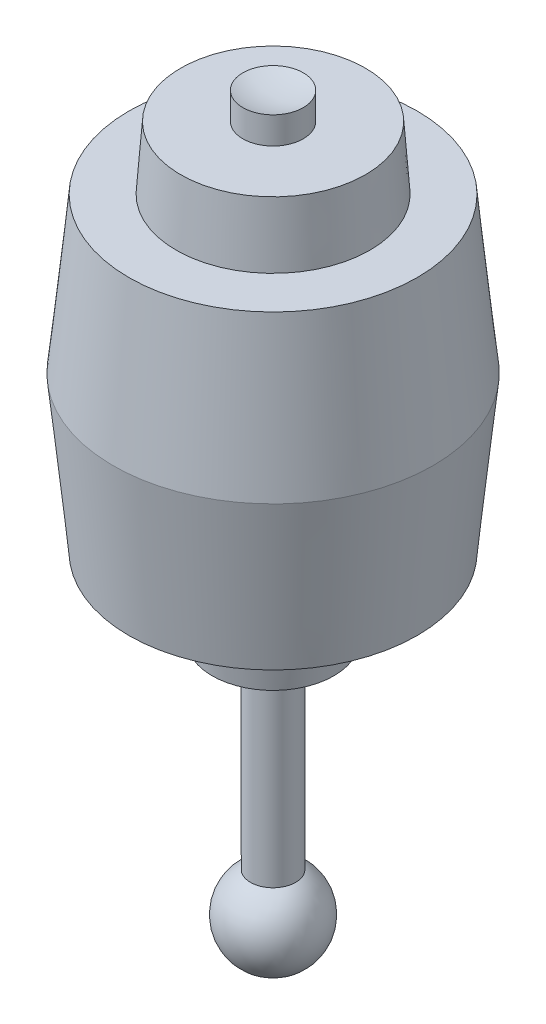
ISO-10303-21;
HEADER;
FILE_DESCRIPTION(('STEP AP214'),'2;1');
FILE_NAME('part.step','',(''),(''),'','','');
FILE_SCHEMA(('AUTOMOTIVE_DESIGN { 1 0 10303 214 1 1 1 1 }'));
ENDSEC;
DATA;
#1=APPLICATION_CONTEXT('core data for automotive mechanical design processes');
#2=APPLICATION_PROTOCOL_DEFINITION('international standard','automotive_design',2000,#1);
#3=PRODUCT_CONTEXT('',#1,'mechanical');
#4=PRODUCT('Part','Part','',(#3));
#5=PRODUCT_RELATED_PRODUCT_CATEGORY('part','',(#4));
#6=PRODUCT_DEFINITION_FORMATION('','',#4);
#7=PRODUCT_DEFINITION_CONTEXT('part definition',#1,'design');
#8=PRODUCT_DEFINITION('design','',#6,#7);
#9=PRODUCT_DEFINITION_SHAPE('','',#8);
#10=(LENGTH_UNIT() NAMED_UNIT(*) SI_UNIT(.MILLI.,.METRE.));
#11=(NAMED_UNIT(*) PLANE_ANGLE_UNIT() SI_UNIT($,.RADIAN.));
#12=(NAMED_UNIT(*) SI_UNIT($,.STERADIAN.) SOLID_ANGLE_UNIT());
#13=UNCERTAINTY_MEASURE_WITH_UNIT(LENGTH_MEASURE(1.E-05),#10,'distance_accuracy_value','');
#14=(GEOMETRIC_REPRESENTATION_CONTEXT(3) GLOBAL_UNCERTAINTY_ASSIGNED_CONTEXT((#13)) GLOBAL_UNIT_ASSIGNED_CONTEXT((#10,
#11,#12)) REPRESENTATION_CONTEXT('',''));
#15=CARTESIAN_POINT('',(0.,0.,0.));
#16=DIRECTION('',(0.,0.,1.));
#17=DIRECTION('',(1.,0.,0.));
#18=AXIS2_PLACEMENT_3D('',#15,#16,#17);
#19=CARTESIAN_POINT('',(0.,-52.,0.));
#20=DIRECTION('',(0.,-1.,0.));
#21=DIRECTION('',(-1.,0.,0.));
#22=AXIS2_PLACEMENT_3D('',#19,#20,#21);
#23=SPHERICAL_SURFACE('',#22,5.);
#24=CARTESIAN_POINT('',(0.,-47.6698729810778,0.));
#25=DIRECTION('',(0.,-1.,0.));
#26=DIRECTION('',(1.,0.,0.));
#27=AXIS2_PLACEMENT_3D('',#24,#25,#26);
#28=CIRCLE('',#27,2.5);
#29=CARTESIAN_POINT('',(2.50000000000001,-47.6698729810778,0.));
#30=VERTEX_POINT('',#29);
#31=EDGE_CURVE('E67',#30,#30,#28,.T.);
#32=ORIENTED_EDGE('',*,*,#31,.T.);
#33=EDGE_LOOP('',(#32));
#34=FACE_BOUND('',#33,.T.);
#35=ADVANCED_FACE('F30',(#34),#23,.T.);
#36=CARTESIAN_POINT('',(0.,36.6221812761165,0.));
#37=DIRECTION('',(0.,-1.,0.));
#38=DIRECTION('',(-1.,0.,0.));
#39=AXIS2_PLACEMENT_3D('',#36,#37,#38);
#40=SPHERICAL_SURFACE('',#39,10.);
#41=CARTESIAN_POINT('',(0.,27.2,0.));
#42=DIRECTION('',(0.,-1.,0.));
#43=DIRECTION('',(1.,0.,0.));
#44=AXIS2_PLACEMENT_3D('',#41,#42,#43);
#45=CIRCLE('',#44,3.35000000000001);
#46=CARTESIAN_POINT('',(3.35000000000002,27.2,0.));
#47=VERTEX_POINT('',#46);
#48=EDGE_CURVE('E10',#47,#47,#45,.T.);
#49=ORIENTED_EDGE('',*,*,#48,.F.);
#50=EDGE_LOOP('',(#49));
#51=FACE_BOUND('',#50,.T.);
#52=ADVANCED_FACE('F127',(#51),#40,.F.);
#53=CARTESIAN_POINT('',(0.,-52.,0.));
#54=DIRECTION('',(0.,-1.,0.));
#55=DIRECTION('',(1.,0.,0.));
#56=AXIS2_PLACEMENT_3D('',#53,#54,#55);
#57=CYLINDRICAL_SURFACE('',#56,3.35);
#58=CARTESIAN_POINT('',(0.,24.2,0.));
#59=DIRECTION('',(0.,-1.,0.));
#60=DIRECTION('',(1.,0.,0.));
#61=AXIS2_PLACEMENT_3D('',#58,#59,#60);
#62=CIRCLE('',#61,3.35);
#63=CARTESIAN_POINT('',(3.35000000000001,24.2,0.));
#64=VERTEX_POINT('',#63);
#65=EDGE_CURVE('E36',#64,#64,#62,.T.);
#66=ORIENTED_EDGE('',*,*,#65,.F.);
#67=EDGE_LOOP('',(#66));
#68=FACE_BOUND('',#67,.T.);
#69=ORIENTED_EDGE('',*,*,#48,.T.);
#70=EDGE_LOOP('',(#69));
#71=FACE_BOUND('',#70,.T.);
#72=ADVANCED_FACE('F122',(#68,#71),#57,.T.);
#73=CARTESIAN_POINT('',(-10.25,24.2,0.));
#74=DIRECTION('',(0.,-1.,0.));
#75=DIRECTION('',(1.,0.,0.));
#76=AXIS2_PLACEMENT_3D('',#73,#74,#75);
#77=PLANE('',#76);
#78=CARTESIAN_POINT('',(0.,24.2,0.));
#79=DIRECTION('',(0.,-1.,0.));
#80=DIRECTION('',(1.,0.,0.));
#81=AXIS2_PLACEMENT_3D('',#78,#79,#80);
#82=CIRCLE('',#81,10.25);
#83=CARTESIAN_POINT('',(10.25,24.2,0.));
#84=VERTEX_POINT('',#83);
#85=EDGE_CURVE('E40',#84,#84,#82,.T.);
#86=ORIENTED_EDGE('',*,*,#85,.F.);
#87=EDGE_LOOP('',(#86));
#88=FACE_BOUND('',#87,.T.);
#89=ORIENTED_EDGE('',*,*,#65,.T.);
#90=EDGE_LOOP('',(#89));
#91=FACE_BOUND('',#90,.T.);
#92=ADVANCED_FACE('F117',(#88,#91),#77,.F.);
#93=CARTESIAN_POINT('',(0.,24.2,0.));
#94=DIRECTION('',(0.,-1.,0.));
#95=DIRECTION('',(1.,0.,0.));
#96=AXIS2_PLACEMENT_3D('',#93,#94,#95);
#97=CONICAL_SURFACE('',#96,10.25,0.0713074647852902);
#98=CARTESIAN_POINT('',(0.,17.2,0.));
#99=DIRECTION('',(0.,-1.,0.));
#100=DIRECTION('',(1.,0.,0.));
#101=AXIS2_PLACEMENT_3D('',#98,#99,#100);
#102=CIRCLE('',#101,10.75);
#103=CARTESIAN_POINT('',(10.75,17.2,0.));
#104=VERTEX_POINT('',#103);
#105=EDGE_CURVE('E44',#104,#104,#102,.T.);
#106=ORIENTED_EDGE('',*,*,#105,.F.);
#107=EDGE_LOOP('',(#106));
#108=FACE_BOUND('',#107,.T.);
#109=ORIENTED_EDGE('',*,*,#85,.T.);
#110=EDGE_LOOP('',(#109));
#111=FACE_BOUND('',#110,.T.);
#112=ADVANCED_FACE('F111',(#108,#111),#97,.T.);
#113=CARTESIAN_POINT('',(-16.,17.2,0.));
#114=DIRECTION('',(0.,-1.,0.));
#115=DIRECTION('',(1.,0.,0.));
#116=AXIS2_PLACEMENT_3D('',#113,#114,#115);
#117=PLANE('',#116);
#118=CARTESIAN_POINT('',(0.,17.2,0.));
#119=DIRECTION('',(0.,-1.,0.));
#120=DIRECTION('',(1.,0.,0.));
#121=AXIS2_PLACEMENT_3D('',#118,#119,#120);
#122=CIRCLE('',#121,16.);
#123=CARTESIAN_POINT('',(16.,17.2,0.));
#124=VERTEX_POINT('',#123);
#125=EDGE_CURVE('E49',#124,#124,#122,.T.);
#126=ORIENTED_EDGE('',*,*,#125,.F.);
#127=EDGE_LOOP('',(#126));
#128=FACE_BOUND('',#127,.T.);
#129=ORIENTED_EDGE('',*,*,#105,.T.);
#130=EDGE_LOOP('',(#129));
#131=FACE_BOUND('',#130,.T.);
#132=ADVANCED_FACE('F105',(#128,#131),#117,.F.);
#133=CARTESIAN_POINT('',(0.,17.2,0.));
#134=DIRECTION('',(0.,-1.,0.));
#135=DIRECTION('',(1.,0.,0.));
#136=AXIS2_PLACEMENT_3D('',#133,#134,#135);
#137=CONICAL_SURFACE('',#136,16.,0.101395269480395);
#138=CARTESIAN_POINT('',(0.,0.,0.));
#139=DIRECTION('',(0.,-1.,0.));
#140=DIRECTION('',(1.,0.,0.));
#141=AXIS2_PLACEMENT_3D('',#138,#139,#140);
#142=CIRCLE('',#141,17.75);
#143=CARTESIAN_POINT('',(17.75,0.,0.));
#144=VERTEX_POINT('',#143);
#145=EDGE_CURVE('E52',#144,#144,#142,.T.);
#146=ORIENTED_EDGE('',*,*,#145,.F.);
#147=EDGE_LOOP('',(#146));
#148=FACE_BOUND('',#147,.T.);
#149=ORIENTED_EDGE('',*,*,#125,.T.);
#150=EDGE_LOOP('',(#149));
#151=FACE_BOUND('',#150,.T.);
#152=ADVANCED_FACE('F99',(#148,#151),#137,.T.);
#153=CARTESIAN_POINT('',(0.,0.,0.));
#154=DIRECTION('',(0.,1.,0.));
#155=DIRECTION('',(-1.,0.,0.));
#156=AXIS2_PLACEMENT_3D('',#153,#154,#155);
#157=CONICAL_SURFACE('',#156,17.75,0.101395269480395);
#158=CARTESIAN_POINT('',(0.,-17.2,0.));
#159=DIRECTION('',(0.,-1.,0.));
#160=DIRECTION('',(1.,0.,0.));
#161=AXIS2_PLACEMENT_3D('',#158,#159,#160);
#162=CIRCLE('',#161,16.);
#163=CARTESIAN_POINT('',(16.,-17.2,0.));
#164=VERTEX_POINT('',#163);
#165=EDGE_CURVE('E55',#164,#164,#162,.T.);
#166=ORIENTED_EDGE('',*,*,#165,.F.);
#167=EDGE_LOOP('',(#166));
#168=FACE_BOUND('',#167,.T.);
#169=ORIENTED_EDGE('',*,*,#145,.T.);
#170=EDGE_LOOP('',(#169));
#171=FACE_BOUND('',#170,.T.);
#172=ADVANCED_FACE('F93',(#168,#171),#157,.T.);
#173=CARTESIAN_POINT('',(-7.74999999999999,-17.2,0.));
#174=DIRECTION('',(0.,1.,0.));
#175=DIRECTION('',(-1.,0.,0.));
#176=AXIS2_PLACEMENT_3D('',#173,#174,#175);
#177=PLANE('',#176);
#178=CARTESIAN_POINT('',(0.,-17.2,0.));
#179=DIRECTION('',(0.,-1.,0.));
#180=DIRECTION('',(1.,0.,0.));
#181=AXIS2_PLACEMENT_3D('',#178,#179,#180);
#182=CIRCLE('',#181,7.75);
#183=CARTESIAN_POINT('',(7.75000000000001,-17.2,0.));
#184=VERTEX_POINT('',#183);
#185=EDGE_CURVE('E58',#184,#184,#182,.T.);
#186=ORIENTED_EDGE('',*,*,#185,.F.);
#187=EDGE_LOOP('',(#186));
#188=FACE_BOUND('',#187,.T.);
#189=ORIENTED_EDGE('',*,*,#165,.T.);
#190=EDGE_LOOP('',(#189));
#191=FACE_BOUND('',#190,.T.);
#192=ADVANCED_FACE('F87',(#188,#191),#177,.F.);
#193=CARTESIAN_POINT('',(0.,-17.2,0.));
#194=DIRECTION('',(0.,1.,0.));
#195=DIRECTION('',(-1.,0.,0.));
#196=AXIS2_PLACEMENT_3D('',#193,#194,#195);
#197=CONICAL_SURFACE('',#196,7.75,0.117108744566864);
#198=CARTESIAN_POINT('',(0.,-25.7,0.));
#199=DIRECTION('',(0.,-1.,0.));
#200=DIRECTION('',(1.,0.,0.));
#201=AXIS2_PLACEMENT_3D('',#198,#199,#200);
#202=CIRCLE('',#201,6.75);
#203=CARTESIAN_POINT('',(6.75000000000001,-25.7,0.));
#204=VERTEX_POINT('',#203);
#205=EDGE_CURVE('E61',#204,#204,#202,.T.);
#206=ORIENTED_EDGE('',*,*,#205,.F.);
#207=EDGE_LOOP('',(#206));
#208=FACE_BOUND('',#207,.T.);
#209=ORIENTED_EDGE('',*,*,#185,.T.);
#210=EDGE_LOOP('',(#209));
#211=FACE_BOUND('',#210,.T.);
#212=ADVANCED_FACE('F81',(#208,#211),#197,.T.);
#213=CARTESIAN_POINT('',(-2.49999999999999,-25.7,0.));
#214=DIRECTION('',(0.,1.,0.));
#215=DIRECTION('',(-1.,0.,0.));
#216=AXIS2_PLACEMENT_3D('',#213,#214,#215);
#217=PLANE('',#216);
#218=CARTESIAN_POINT('',(0.,-25.7,0.));
#219=DIRECTION('',(0.,-1.,0.));
#220=DIRECTION('',(1.,0.,0.));
#221=AXIS2_PLACEMENT_3D('',#218,#219,#220);
#222=CIRCLE('',#221,2.5);
#223=CARTESIAN_POINT('',(2.50000000000001,-25.7,0.));
#224=VERTEX_POINT('',#223);
#225=EDGE_CURVE('E64',#224,#224,#222,.T.);
#226=ORIENTED_EDGE('',*,*,#225,.F.);
#227=EDGE_LOOP('',(#226));
#228=FACE_BOUND('',#227,.T.);
#229=ORIENTED_EDGE('',*,*,#205,.T.);
#230=EDGE_LOOP('',(#229));
#231=FACE_BOUND('',#230,.T.);
#232=ADVANCED_FACE('F75',(#228,#231),#217,.F.);
#233=CARTESIAN_POINT('',(0.,-52.,0.));
#234=DIRECTION('',(0.,-1.,0.));
#235=DIRECTION('',(1.,0.,0.));
#236=AXIS2_PLACEMENT_3D('',#233,#234,#235);
#237=CYLINDRICAL_SURFACE('',#236,2.5);
#238=ORIENTED_EDGE('',*,*,#31,.F.);
#239=EDGE_LOOP('',(#238));
#240=FACE_BOUND('',#239,.T.);
#241=ORIENTED_EDGE('',*,*,#225,.T.);
#242=EDGE_LOOP('',(#241));
#243=FACE_BOUND('',#242,.T.);
#244=ADVANCED_FACE('F72',(#240,#243),#237,.T.);
#245=CLOSED_SHELL('',(#35,#52,#72,#92,#112,#132,#152,#172,#192,#212,#232,#244));
#246=MANIFOLD_SOLID_BREP('B2',#245);
#247=ADVANCED_BREP_SHAPE_REPRESENTATION('',(#18,#246),#14);
#248=SHAPE_DEFINITION_REPRESENTATION(#9,#247);
ENDSEC;
END-ISO-10303-21;
